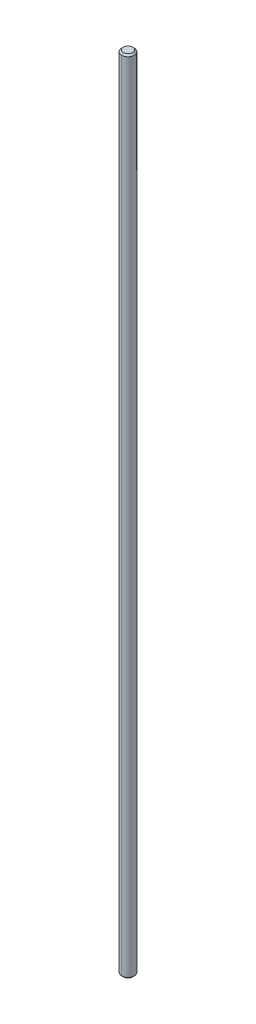
ISO-10303-21;
HEADER;
FILE_DESCRIPTION(('STEP AP214'),'2;1');
FILE_NAME('part.step','',(''),(''),'','','');
FILE_SCHEMA(('AUTOMOTIVE_DESIGN { 1 0 10303 214 1 1 1 1 }'));
ENDSEC;
DATA;
#1=APPLICATION_CONTEXT('core data for automotive mechanical design processes');
#2=APPLICATION_PROTOCOL_DEFINITION('international standard','automotive_design',2000,#1);
#3=PRODUCT_CONTEXT('',#1,'mechanical');
#4=PRODUCT('Part','Part','',(#3));
#5=PRODUCT_RELATED_PRODUCT_CATEGORY('part','',(#4));
#6=PRODUCT_DEFINITION_FORMATION('','',#4);
#7=PRODUCT_DEFINITION_CONTEXT('part definition',#1,'design');
#8=PRODUCT_DEFINITION('design','',#6,#7);
#9=PRODUCT_DEFINITION_SHAPE('','',#8);
#10=(LENGTH_UNIT() NAMED_UNIT(*) SI_UNIT(.MILLI.,.METRE.));
#11=(NAMED_UNIT(*) PLANE_ANGLE_UNIT() SI_UNIT($,.RADIAN.));
#12=(NAMED_UNIT(*) SI_UNIT($,.STERADIAN.) SOLID_ANGLE_UNIT());
#13=UNCERTAINTY_MEASURE_WITH_UNIT(LENGTH_MEASURE(1.E-05),#10,'distance_accuracy_value','');
#14=(GEOMETRIC_REPRESENTATION_CONTEXT(3) GLOBAL_UNCERTAINTY_ASSIGNED_CONTEXT((#13)) GLOBAL_UNIT_ASSIGNED_CONTEXT((#10,
#11,#12)) REPRESENTATION_CONTEXT('',''));
#15=CARTESIAN_POINT('',(0.,0.,0.));
#16=DIRECTION('',(0.,0.,1.));
#17=DIRECTION('',(1.,0.,0.));
#18=AXIS2_PLACEMENT_3D('',#15,#16,#17);
#19=CARTESIAN_POINT('',(0.,1.,0.));
#20=DIRECTION('',(0.,1.,0.));
#21=DIRECTION('',(0.,0.,1.));
#22=AXIS2_PLACEMENT_3D('',#19,#20,#21);
#23=CONICAL_SURFACE('',#22,4.,0.785398163397474);
#24=DIRECTION('',(0.,0.707106781186529,-0.707106781186566));
#25=VECTOR('',#24,1.);
#26=CARTESIAN_POINT('',(0.,1.,-4.));
#27=LINE('',#26,#25);
#28=CARTESIAN_POINT('',(0.,0.,-2.99999999999994));
#29=VERTEX_POINT('',#28);
#30=CARTESIAN_POINT('',(0.,1.,-4.));
#31=VERTEX_POINT('',#30);
#32=EDGE_CURVE('E78',#29,#31,#27,.T.);
#33=ORIENTED_EDGE('',*,*,#32,.F.);
#34=CARTESIAN_POINT('',(0.,0.,0.));
#35=DIRECTION('',(0.,-1.,0.));
#36=DIRECTION('',(0.,0.,1.));
#37=AXIS2_PLACEMENT_3D('',#34,#35,#36);
#38=CIRCLE('',#37,2.99999999999994);
#39=CARTESIAN_POINT('',(0.,0.,2.99999999999994));
#40=VERTEX_POINT('',#39);
#41=EDGE_CURVE('E11',#40,#29,#38,.T.);
#42=ORIENTED_EDGE('',*,*,#41,.F.);
#43=DIRECTION('',(0.,0.707106781186529,0.707106781186566));
#44=VECTOR('',#43,1.);
#45=CARTESIAN_POINT('',(0.,1.,4.));
#46=LINE('',#45,#44);
#47=CARTESIAN_POINT('',(0.,1.,4.));
#48=VERTEX_POINT('',#47);
#49=EDGE_CURVE('E81',#40,#48,#46,.T.);
#50=ORIENTED_EDGE('',*,*,#49,.T.);
#51=CARTESIAN_POINT('',(0.,1.,0.));
#52=DIRECTION('',(0.,1.,0.));
#53=DIRECTION('',(0.,0.,1.));
#54=AXIS2_PLACEMENT_3D('',#51,#52,#53);
#55=CIRCLE('',#54,4.);
#56=EDGE_CURVE('E76',#31,#48,#55,.T.);
#57=ORIENTED_EDGE('',*,*,#56,.F.);
#58=EDGE_LOOP('',(#33,#42,#50,#57));
#59=FACE_BOUND('',#58,.T.);
#60=ADVANCED_FACE('F18',(#59),#23,.T.);
#61=CARTESIAN_POINT('',(0.,510.,0.));
#62=DIRECTION('',(0.,-1.,0.));
#63=DIRECTION('',(0.,0.,-1.));
#64=AXIS2_PLACEMENT_3D('',#61,#62,#63);
#65=CONICAL_SURFACE('',#64,3.00000000000012,0.785398163397446);
#66=DIRECTION('',(0.,-0.707106781186549,0.707106781186546));
#67=VECTOR('',#66,1.);
#68=CARTESIAN_POINT('',(0.,510.,3.00000000000012));
#69=LINE('',#68,#67);
#70=CARTESIAN_POINT('',(0.,510.,3.00000000000012));
#71=VERTEX_POINT('',#70);
#72=CARTESIAN_POINT('',(0.,509.,4.));
#73=VERTEX_POINT('',#72);
#74=EDGE_CURVE('E117',#71,#73,#69,.T.);
#75=ORIENTED_EDGE('',*,*,#74,.F.);
#76=CARTESIAN_POINT('',(0.,510.,0.));
#77=DIRECTION('',(0.,1.,0.));
#78=DIRECTION('',(0.,0.,1.));
#79=AXIS2_PLACEMENT_3D('',#76,#77,#78);
#80=CIRCLE('',#79,3.00000000000012);
#81=CARTESIAN_POINT('',(0.,510.,-3.00000000000012));
#82=VERTEX_POINT('',#81);
#83=EDGE_CURVE('E27',#82,#71,#80,.T.);
#84=ORIENTED_EDGE('',*,*,#83,.F.);
#85=DIRECTION('',(0.,-0.707106781186549,-0.707106781186546));
#86=VECTOR('',#85,1.);
#87=CARTESIAN_POINT('',(0.,510.,-3.00000000000012));
#88=LINE('',#87,#86);
#89=CARTESIAN_POINT('',(0.,509.,-4.));
#90=VERTEX_POINT('',#89);
#91=EDGE_CURVE('E116',#82,#90,#88,.T.);
#92=ORIENTED_EDGE('',*,*,#91,.T.);
#93=CARTESIAN_POINT('',(0.,509.,0.));
#94=DIRECTION('',(0.,-1.,0.));
#95=DIRECTION('',(0.,0.,1.));
#96=AXIS2_PLACEMENT_3D('',#93,#94,#95);
#97=CIRCLE('',#96,4.);
#98=EDGE_CURVE('E40',#73,#90,#97,.T.);
#99=ORIENTED_EDGE('',*,*,#98,.F.);
#100=EDGE_LOOP('',(#75,#84,#92,#99));
#101=FACE_BOUND('',#100,.T.);
#102=ADVANCED_FACE('F20',(#101),#65,.T.);
#103=CARTESIAN_POINT('',(0.,0.,0.));
#104=DIRECTION('',(0.,1.,0.));
#105=DIRECTION('',(1.,0.,0.));
#106=AXIS2_PLACEMENT_3D('',#103,#104,#105);
#107=PLANE('',#106);
#108=ORIENTED_EDGE('',*,*,#41,.T.);
#109=CARTESIAN_POINT('',(0.,0.,0.));
#110=DIRECTION('',(0.,-1.,0.));
#111=DIRECTION('',(0.,0.,1.));
#112=AXIS2_PLACEMENT_3D('',#109,#110,#111);
#113=CIRCLE('',#112,2.99999999999994);
#114=EDGE_CURVE('E100',#29,#40,#113,.T.);
#115=ORIENTED_EDGE('',*,*,#114,.T.);
#116=EDGE_LOOP('',(#108,#115));
#117=FACE_BOUND('',#116,.T.);
#118=ADVANCED_FACE('F222',(#117),#107,.F.);
#119=CARTESIAN_POINT('',(0.,510.,0.));
#120=DIRECTION('',(0.,1.,0.));
#121=DIRECTION('',(1.,0.,0.));
#122=AXIS2_PLACEMENT_3D('',#119,#120,#121);
#123=PLANE('',#122);
#124=ORIENTED_EDGE('',*,*,#83,.T.);
#125=CARTESIAN_POINT('',(0.,510.,0.));
#126=DIRECTION('',(0.,1.,0.));
#127=DIRECTION('',(0.,0.,1.));
#128=AXIS2_PLACEMENT_3D('',#125,#126,#127);
#129=CIRCLE('',#128,3.00000000000012);
#130=EDGE_CURVE('E111',#71,#82,#129,.T.);
#131=ORIENTED_EDGE('',*,*,#130,.T.);
#132=EDGE_LOOP('',(#124,#131));
#133=FACE_BOUND('',#132,.T.);
#134=ADVANCED_FACE('F217',(#133),#123,.T.);
#135=CARTESIAN_POINT('',(0.,510.,0.));
#136=DIRECTION('',(0.,-1.,0.));
#137=DIRECTION('',(0.,0.,-1.));
#138=AXIS2_PLACEMENT_3D('',#135,#136,#137);
#139=CYLINDRICAL_SURFACE('',#138,4.);
#140=DIRECTION('',(0.,-1.,0.));
#141=VECTOR('',#140,1.);
#142=CARTESIAN_POINT('',(0.,510.,4.));
#143=LINE('',#142,#141);
#144=EDGE_CURVE('E92',#73,#48,#143,.T.);
#145=ORIENTED_EDGE('',*,*,#144,.F.);
#146=ORIENTED_EDGE('',*,*,#98,.T.);
#147=DIRECTION('',(0.,-1.,0.));
#148=VECTOR('',#147,1.);
#149=CARTESIAN_POINT('',(0.,510.,-4.));
#150=LINE('',#149,#148);
#151=EDGE_CURVE('E86',#90,#31,#150,.T.);
#152=ORIENTED_EDGE('',*,*,#151,.T.);
#153=ORIENTED_EDGE('',*,*,#56,.T.);
#154=EDGE_LOOP('',(#145,#146,#152,#153));
#155=FACE_BOUND('',#154,.T.);
#156=ADVANCED_FACE('F88',(#155),#139,.T.);
#157=CARTESIAN_POINT('',(0.,510.,0.));
#158=DIRECTION('',(0.,-1.,0.));
#159=DIRECTION('',(0.,0.,-1.));
#160=AXIS2_PLACEMENT_3D('',#157,#158,#159);
#161=CYLINDRICAL_SURFACE('',#160,4.);
#162=CARTESIAN_POINT('',(0.,509.,0.));
#163=DIRECTION('',(0.,-1.,0.));
#164=DIRECTION('',(0.,0.,1.));
#165=AXIS2_PLACEMENT_3D('',#162,#163,#164);
#166=CIRCLE('',#165,4.);
#167=EDGE_CURVE('E113',#90,#73,#166,.T.);
#168=ORIENTED_EDGE('',*,*,#167,.T.);
#169=ORIENTED_EDGE('',*,*,#144,.T.);
#170=CARTESIAN_POINT('',(0.,1.,0.));
#171=DIRECTION('',(0.,1.,0.));
#172=DIRECTION('',(0.,0.,1.));
#173=AXIS2_PLACEMENT_3D('',#170,#171,#172);
#174=CIRCLE('',#173,4.);
#175=EDGE_CURVE('E93',#48,#31,#174,.T.);
#176=ORIENTED_EDGE('',*,*,#175,.T.);
#177=ORIENTED_EDGE('',*,*,#151,.F.);
#178=EDGE_LOOP('',(#168,#169,#176,#177));
#179=FACE_BOUND('',#178,.T.);
#180=ADVANCED_FACE('F94',(#179),#161,.T.);
#181=CARTESIAN_POINT('',(0.,510.,0.));
#182=DIRECTION('',(0.,-1.,0.));
#183=DIRECTION('',(0.,0.,-1.));
#184=AXIS2_PLACEMENT_3D('',#181,#182,#183);
#185=CONICAL_SURFACE('',#184,3.00000000000012,0.785398163397446);
#186=ORIENTED_EDGE('',*,*,#130,.F.);
#187=ORIENTED_EDGE('',*,*,#74,.T.);
#188=ORIENTED_EDGE('',*,*,#167,.F.);
#189=ORIENTED_EDGE('',*,*,#91,.F.);
#190=EDGE_LOOP('',(#186,#187,#188,#189));
#191=FACE_BOUND('',#190,.T.);
#192=ADVANCED_FACE('F197',(#191),#185,.T.);
#193=CARTESIAN_POINT('',(0.,1.,0.));
#194=DIRECTION('',(0.,1.,0.));
#195=DIRECTION('',(0.,0.,1.));
#196=AXIS2_PLACEMENT_3D('',#193,#194,#195);
#197=CONICAL_SURFACE('',#196,4.,0.785398163397474);
#198=ORIENTED_EDGE('',*,*,#114,.F.);
#199=ORIENTED_EDGE('',*,*,#32,.T.);
#200=ORIENTED_EDGE('',*,*,#175,.F.);
#201=ORIENTED_EDGE('',*,*,#49,.F.);
#202=EDGE_LOOP('',(#198,#199,#200,#201));
#203=FACE_BOUND('',#202,.T.);
#204=ADVANCED_FACE('F98',(#203),#197,.T.);
#205=CLOSED_SHELL('',(#60,#102,#118,#134,#156,#180,#192,#204));
#206=MANIFOLD_SOLID_BREP('B1',#205);
#207=ADVANCED_BREP_SHAPE_REPRESENTATION('',(#18,#206),#14);
#208=SHAPE_DEFINITION_REPRESENTATION(#9,#207);
ENDSEC;
END-ISO-10303-21;
